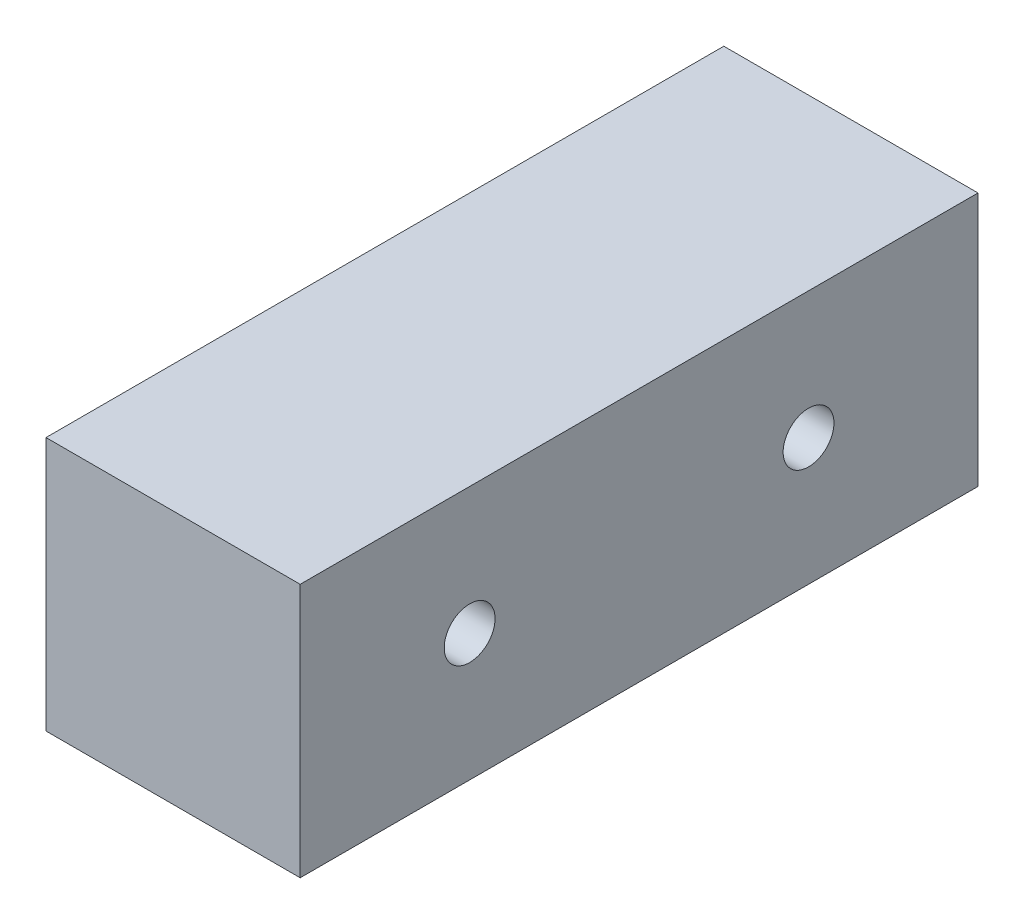
ISO-10303-21;
HEADER;
FILE_DESCRIPTION(('STEP AP214'),'2;1');
FILE_NAME('part.step','',(''),(''),'','','');
FILE_SCHEMA(('AUTOMOTIVE_DESIGN { 1 0 10303 214 1 1 1 1 }'));
ENDSEC;
DATA;
#1=APPLICATION_CONTEXT('core data for automotive mechanical design processes');
#2=APPLICATION_PROTOCOL_DEFINITION('international standard','automotive_design',2000,#1);
#3=PRODUCT_CONTEXT('',#1,'mechanical');
#4=PRODUCT('Part','Part','',(#3));
#5=PRODUCT_RELATED_PRODUCT_CATEGORY('part','',(#4));
#6=PRODUCT_DEFINITION_FORMATION('','',#4);
#7=PRODUCT_DEFINITION_CONTEXT('part definition',#1,'design');
#8=PRODUCT_DEFINITION('design','',#6,#7);
#9=PRODUCT_DEFINITION_SHAPE('','',#8);
#10=(LENGTH_UNIT() NAMED_UNIT(*) SI_UNIT(.MILLI.,.METRE.));
#11=(NAMED_UNIT(*) PLANE_ANGLE_UNIT() SI_UNIT($,.RADIAN.));
#12=(NAMED_UNIT(*) SI_UNIT($,.STERADIAN.) SOLID_ANGLE_UNIT());
#13=UNCERTAINTY_MEASURE_WITH_UNIT(LENGTH_MEASURE(1.E-05),#10,'distance_accuracy_value','');
#14=(GEOMETRIC_REPRESENTATION_CONTEXT(3) GLOBAL_UNCERTAINTY_ASSIGNED_CONTEXT((#13)) GLOBAL_UNIT_ASSIGNED_CONTEXT((#10,
#11,#12)) REPRESENTATION_CONTEXT('',''));
#15=CARTESIAN_POINT('',(0.,0.,0.));
#16=DIRECTION('',(0.,0.,1.));
#17=DIRECTION('',(1.,0.,0.));
#18=AXIS2_PLACEMENT_3D('',#15,#16,#17);
#19=CARTESIAN_POINT('',(75.,150.,-200.));
#20=DIRECTION('',(-1.,0.,0.));
#21=DIRECTION('',(0.,0.,1.));
#22=AXIS2_PLACEMENT_3D('',#19,#20,#21);
#23=PLANE('',#22);
#24=CARTESIAN_POINT('',(75.,75.,100.));
#25=DIRECTION('',(1.,0.,0.));
#26=DIRECTION('',(0.,0.,-1.));
#27=AXIS2_PLACEMENT_3D('',#24,#25,#26);
#28=CIRCLE('',#27,15.);
#29=CARTESIAN_POINT('',(75.,75.,85.));
#30=VERTEX_POINT('',#29);
#31=EDGE_CURVE('E136',#30,#30,#28,.T.);
#32=ORIENTED_EDGE('',*,*,#31,.F.);
#33=EDGE_LOOP('',(#32));
#34=FACE_BOUND('',#33,.T.);
#35=CARTESIAN_POINT('',(75.,75.,-100.));
#36=DIRECTION('',(1.,0.,0.));
#37=DIRECTION('',(0.,0.,-1.));
#38=AXIS2_PLACEMENT_3D('',#35,#36,#37);
#39=CIRCLE('',#38,15.);
#40=CARTESIAN_POINT('',(75.,75.,-115.));
#41=VERTEX_POINT('',#40);
#42=EDGE_CURVE('E128',#41,#41,#39,.T.);
#43=ORIENTED_EDGE('',*,*,#42,.F.);
#44=EDGE_LOOP('',(#43));
#45=FACE_BOUND('',#44,.T.);
#46=DIRECTION('',(0.,0.,-1.));
#47=VECTOR('',#46,1.);
#48=CARTESIAN_POINT('',(75.,0.,-200.));
#49=LINE('',#48,#47);
#50=CARTESIAN_POINT('',(75.,0.,200.));
#51=VERTEX_POINT('',#50);
#52=CARTESIAN_POINT('',(75.,0.,-200.));
#53=VERTEX_POINT('',#52);
#54=EDGE_CURVE('E107',#51,#53,#49,.T.);
#55=ORIENTED_EDGE('',*,*,#54,.T.);
#56=DIRECTION('',(0.,-1.,0.));
#57=VECTOR('',#56,1.);
#58=CARTESIAN_POINT('',(75.,150.,-200.));
#59=LINE('',#58,#57);
#60=CARTESIAN_POINT('',(75.,150.,-200.));
#61=VERTEX_POINT('',#60);
#62=EDGE_CURVE('E11',#61,#53,#59,.T.);
#63=ORIENTED_EDGE('',*,*,#62,.F.);
#64=DIRECTION('',(0.,0.,-1.));
#65=VECTOR('',#64,1.);
#66=CARTESIAN_POINT('',(75.,150.,-200.));
#67=LINE('',#66,#65);
#68=CARTESIAN_POINT('',(75.,150.,200.));
#69=VERTEX_POINT('',#68);
#70=EDGE_CURVE('E91',#69,#61,#67,.T.);
#71=ORIENTED_EDGE('',*,*,#70,.F.);
#72=DIRECTION('',(0.,-1.,0.));
#73=VECTOR('',#72,1.);
#74=CARTESIAN_POINT('',(75.,150.,200.));
#75=LINE('',#74,#73);
#76=EDGE_CURVE('E103',#69,#51,#75,.T.);
#77=ORIENTED_EDGE('',*,*,#76,.T.);
#78=EDGE_LOOP('',(#55,#63,#71,#77));
#79=FACE_BOUND('',#78,.T.);
#80=ADVANCED_FACE('F39',(#34,#45,#79),#23,.F.);
#81=CARTESIAN_POINT('',(-75.,150.,-200.));
#82=DIRECTION('',(0.,0.,1.));
#83=DIRECTION('',(1.,0.,0.));
#84=AXIS2_PLACEMENT_3D('',#81,#82,#83);
#85=PLANE('',#84);
#86=DIRECTION('',(-1.,0.,0.));
#87=VECTOR('',#86,1.);
#88=CARTESIAN_POINT('',(-75.,0.,-200.));
#89=LINE('',#88,#87);
#90=CARTESIAN_POINT('',(-75.,0.,-200.));
#91=VERTEX_POINT('',#90);
#92=EDGE_CURVE('E96',#53,#91,#89,.T.);
#93=ORIENTED_EDGE('',*,*,#92,.T.);
#94=DIRECTION('',(0.,-1.,0.));
#95=VECTOR('',#94,1.);
#96=CARTESIAN_POINT('',(-75.,150.,-200.));
#97=LINE('',#96,#95);
#98=CARTESIAN_POINT('',(-75.,150.,-200.));
#99=VERTEX_POINT('',#98);
#100=EDGE_CURVE('E48',#99,#91,#97,.T.);
#101=ORIENTED_EDGE('',*,*,#100,.F.);
#102=DIRECTION('',(-1.,0.,0.));
#103=VECTOR('',#102,1.);
#104=CARTESIAN_POINT('',(-75.,150.,-200.));
#105=LINE('',#104,#103);
#106=EDGE_CURVE('E86',#61,#99,#105,.T.);
#107=ORIENTED_EDGE('',*,*,#106,.F.);
#108=ORIENTED_EDGE('',*,*,#62,.T.);
#109=EDGE_LOOP('',(#93,#101,#107,#108));
#110=FACE_BOUND('',#109,.T.);
#111=ADVANCED_FACE('F95',(#110),#85,.F.);
#112=CARTESIAN_POINT('',(-75.,150.,-200.));
#113=DIRECTION('',(1.,0.,0.));
#114=DIRECTION('',(0.,0.,-1.));
#115=AXIS2_PLACEMENT_3D('',#112,#113,#114);
#116=PLANE('',#115);
#117=CARTESIAN_POINT('',(-75.,75.,100.));
#118=DIRECTION('',(1.,0.,0.));
#119=DIRECTION('',(0.,0.,-1.));
#120=AXIS2_PLACEMENT_3D('',#117,#118,#119);
#121=CIRCLE('',#120,15.);
#122=CARTESIAN_POINT('',(-75.,75.,85.));
#123=VERTEX_POINT('',#122);
#124=EDGE_CURVE('E111',#123,#123,#121,.T.);
#125=ORIENTED_EDGE('',*,*,#124,.T.);
#126=EDGE_LOOP('',(#125));
#127=FACE_BOUND('',#126,.T.);
#128=CARTESIAN_POINT('',(-75.,75.,-100.));
#129=DIRECTION('',(1.,0.,0.));
#130=DIRECTION('',(0.,0.,-1.));
#131=AXIS2_PLACEMENT_3D('',#128,#129,#130);
#132=CIRCLE('',#131,15.);
#133=CARTESIAN_POINT('',(-75.,75.,-115.));
#134=VERTEX_POINT('',#133);
#135=EDGE_CURVE('E132',#134,#134,#132,.T.);
#136=ORIENTED_EDGE('',*,*,#135,.T.);
#137=EDGE_LOOP('',(#136));
#138=FACE_BOUND('',#137,.T.);
#139=DIRECTION('',(0.,0.,1.));
#140=VECTOR('',#139,1.);
#141=CARTESIAN_POINT('',(-75.,0.,-200.));
#142=LINE('',#141,#140);
#143=CARTESIAN_POINT('',(-75.,0.,200.));
#144=VERTEX_POINT('',#143);
#145=EDGE_CURVE('E73',#91,#144,#142,.T.);
#146=ORIENTED_EDGE('',*,*,#145,.T.);
#147=DIRECTION('',(0.,-1.,0.));
#148=VECTOR('',#147,1.);
#149=CARTESIAN_POINT('',(-75.,150.,200.));
#150=LINE('',#149,#148);
#151=CARTESIAN_POINT('',(-75.,150.,200.));
#152=VERTEX_POINT('',#151);
#153=EDGE_CURVE('E98',#152,#144,#150,.T.);
#154=ORIENTED_EDGE('',*,*,#153,.F.);
#155=DIRECTION('',(0.,0.,1.));
#156=VECTOR('',#155,1.);
#157=CARTESIAN_POINT('',(-75.,150.,-200.));
#158=LINE('',#157,#156);
#159=EDGE_CURVE('E89',#99,#152,#158,.T.);
#160=ORIENTED_EDGE('',*,*,#159,.F.);
#161=ORIENTED_EDGE('',*,*,#100,.T.);
#162=EDGE_LOOP('',(#146,#154,#160,#161));
#163=FACE_BOUND('',#162,.T.);
#164=ADVANCED_FACE('F99',(#127,#138,#163),#116,.F.);
#165=CARTESIAN_POINT('',(-75.,150.,200.));
#166=DIRECTION('',(0.,0.,-1.));
#167=DIRECTION('',(-1.,0.,0.));
#168=AXIS2_PLACEMENT_3D('',#165,#166,#167);
#169=PLANE('',#168);
#170=DIRECTION('',(1.,0.,0.));
#171=VECTOR('',#170,1.);
#172=CARTESIAN_POINT('',(-75.,0.,200.));
#173=LINE('',#172,#171);
#174=EDGE_CURVE('E79',#144,#51,#173,.T.);
#175=ORIENTED_EDGE('',*,*,#174,.T.);
#176=ORIENTED_EDGE('',*,*,#76,.F.);
#177=DIRECTION('',(1.,0.,0.));
#178=VECTOR('',#177,1.);
#179=CARTESIAN_POINT('',(-75.,150.,200.));
#180=LINE('',#179,#178);
#181=EDGE_CURVE('E56',#152,#69,#180,.T.);
#182=ORIENTED_EDGE('',*,*,#181,.F.);
#183=ORIENTED_EDGE('',*,*,#153,.T.);
#184=EDGE_LOOP('',(#175,#176,#182,#183));
#185=FACE_BOUND('',#184,.T.);
#186=ADVANCED_FACE('F121',(#185),#169,.F.);
#187=CARTESIAN_POINT('',(0.,150.,0.));
#188=DIRECTION('',(0.,1.,0.));
#189=DIRECTION('',(0.,0.,1.));
#190=AXIS2_PLACEMENT_3D('',#187,#188,#189);
#191=PLANE('',#190);
#192=ORIENTED_EDGE('',*,*,#70,.T.);
#193=ORIENTED_EDGE('',*,*,#106,.T.);
#194=ORIENTED_EDGE('',*,*,#159,.T.);
#195=ORIENTED_EDGE('',*,*,#181,.T.);
#196=EDGE_LOOP('',(#192,#193,#194,#195));
#197=FACE_BOUND('',#196,.T.);
#198=ADVANCED_FACE('F87',(#197),#191,.T.);
#199=CARTESIAN_POINT('',(0.,0.,0.));
#200=DIRECTION('',(0.,1.,0.));
#201=DIRECTION('',(0.,0.,1.));
#202=AXIS2_PLACEMENT_3D('',#199,#200,#201);
#203=PLANE('',#202);
#204=ORIENTED_EDGE('',*,*,#54,.F.);
#205=ORIENTED_EDGE('',*,*,#174,.F.);
#206=ORIENTED_EDGE('',*,*,#145,.F.);
#207=ORIENTED_EDGE('',*,*,#92,.F.);
#208=EDGE_LOOP('',(#204,#205,#206,#207));
#209=FACE_BOUND('',#208,.T.);
#210=ADVANCED_FACE('F124',(#209),#203,.F.);
#211=CARTESIAN_POINT('',(-75.,75.,-100.));
#212=DIRECTION('',(1.,0.,0.));
#213=DIRECTION('',(0.,0.,-1.));
#214=AXIS2_PLACEMENT_3D('',#211,#212,#213);
#215=CYLINDRICAL_SURFACE('',#214,15.);
#216=ORIENTED_EDGE('',*,*,#135,.F.);
#217=EDGE_LOOP('',(#216));
#218=FACE_BOUND('',#217,.T.);
#219=ORIENTED_EDGE('',*,*,#42,.T.);
#220=EDGE_LOOP('',(#219));
#221=FACE_BOUND('',#220,.T.);
#222=ADVANCED_FACE('F149',(#218,#221),#215,.F.);
#223=CARTESIAN_POINT('',(-75.,75.,100.));
#224=DIRECTION('',(1.,0.,0.));
#225=DIRECTION('',(0.,0.,-1.));
#226=AXIS2_PLACEMENT_3D('',#223,#224,#225);
#227=CYLINDRICAL_SURFACE('',#226,15.);
#228=ORIENTED_EDGE('',*,*,#124,.F.);
#229=EDGE_LOOP('',(#228));
#230=FACE_BOUND('',#229,.T.);
#231=ORIENTED_EDGE('',*,*,#31,.T.);
#232=EDGE_LOOP('',(#231));
#233=FACE_BOUND('',#232,.T.);
#234=ADVANCED_FACE('F146',(#230,#233),#227,.F.);
#235=CLOSED_SHELL('',(#80,#111,#164,#186,#198,#210,#222,#234));
#236=MANIFOLD_SOLID_BREP('B2',#235);
#237=ADVANCED_BREP_SHAPE_REPRESENTATION('',(#18,#236),#14);
#238=SHAPE_DEFINITION_REPRESENTATION(#9,#237);
ENDSEC;
END-ISO-10303-21;
